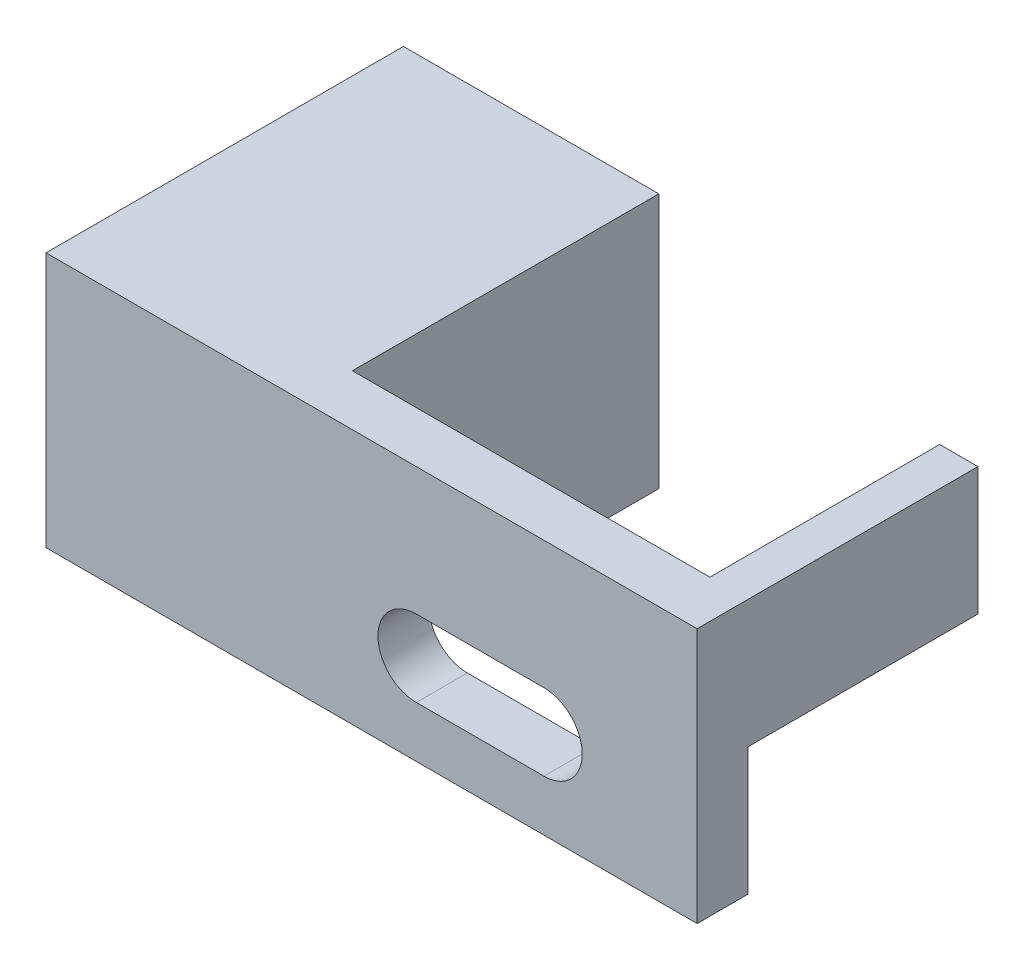
ISO-10303-21;
HEADER;
FILE_DESCRIPTION(('STEP AP214'),'2;1');
FILE_NAME('part.step','',(''),(''),'','','');
FILE_SCHEMA(('AUTOMOTIVE_DESIGN { 1 0 10303 214 1 1 1 1 }'));
ENDSEC;
DATA;
#1=APPLICATION_CONTEXT('core data for automotive mechanical design processes');
#2=APPLICATION_PROTOCOL_DEFINITION('international standard','automotive_design',2000,#1);
#3=PRODUCT_CONTEXT('',#1,'mechanical');
#4=PRODUCT('Part','Part','',(#3));
#5=PRODUCT_RELATED_PRODUCT_CATEGORY('part','',(#4));
#6=PRODUCT_DEFINITION_FORMATION('','',#4);
#7=PRODUCT_DEFINITION_CONTEXT('part definition',#1,'design');
#8=PRODUCT_DEFINITION('design','',#6,#7);
#9=PRODUCT_DEFINITION_SHAPE('','',#8);
#10=(LENGTH_UNIT() NAMED_UNIT(*) SI_UNIT(.MILLI.,.METRE.));
#11=(NAMED_UNIT(*) PLANE_ANGLE_UNIT() SI_UNIT($,.RADIAN.));
#12=(NAMED_UNIT(*) SI_UNIT($,.STERADIAN.) SOLID_ANGLE_UNIT());
#13=UNCERTAINTY_MEASURE_WITH_UNIT(LENGTH_MEASURE(1.E-05),#10,'distance_accuracy_value','');
#14=(GEOMETRIC_REPRESENTATION_CONTEXT(3) GLOBAL_UNCERTAINTY_ASSIGNED_CONTEXT((#13)) GLOBAL_UNIT_ASSIGNED_CONTEXT((#10,
#11,#12)) REPRESENTATION_CONTEXT('',''));
#15=CARTESIAN_POINT('',(0.,0.,0.));
#16=DIRECTION('',(0.,0.,1.));
#17=DIRECTION('',(1.,0.,0.));
#18=AXIS2_PLACEMENT_3D('',#15,#16,#17);
#19=CARTESIAN_POINT('',(0.,10.,-14.));
#20=DIRECTION('',(1.,0.,0.));
#21=DIRECTION('',(0.,0.,-1.));
#22=AXIS2_PLACEMENT_3D('',#19,#20,#21);
#23=PLANE('',#22);
#24=DIRECTION('',(0.,0.,1.));
#25=VECTOR('',#24,1.);
#26=CARTESIAN_POINT('',(0.,0.,-14.));
#27=LINE('',#26,#25);
#28=CARTESIAN_POINT('',(0.,0.,-14.));
#29=VERTEX_POINT('',#28);
#30=CARTESIAN_POINT('',(0.,0.,0.));
#31=VERTEX_POINT('',#30);
#32=EDGE_CURVE('E174',#29,#31,#27,.T.);
#33=ORIENTED_EDGE('',*,*,#32,.T.);
#34=DIRECTION('',(0.,-1.,0.));
#35=VECTOR('',#34,1.);
#36=CARTESIAN_POINT('',(0.,10.,0.));
#37=LINE('',#36,#35);
#38=CARTESIAN_POINT('',(0.,10.,0.));
#39=VERTEX_POINT('',#38);
#40=EDGE_CURVE('E11',#39,#31,#37,.T.);
#41=ORIENTED_EDGE('',*,*,#40,.F.);
#42=DIRECTION('',(0.,0.,1.));
#43=VECTOR('',#42,1.);
#44=CARTESIAN_POINT('',(0.,10.,-14.));
#45=LINE('',#44,#43);
#46=CARTESIAN_POINT('',(0.,10.,-14.));
#47=VERTEX_POINT('',#46);
#48=EDGE_CURVE('E176',#47,#39,#45,.T.);
#49=ORIENTED_EDGE('',*,*,#48,.F.);
#50=DIRECTION('',(0.,-1.,0.));
#51=VECTOR('',#50,1.);
#52=CARTESIAN_POINT('',(0.,10.,-14.));
#53=LINE('',#52,#51);
#54=EDGE_CURVE('E194',#47,#29,#53,.T.);
#55=ORIENTED_EDGE('',*,*,#54,.T.);
#56=EDGE_LOOP('',(#33,#41,#49,#55));
#57=FACE_BOUND('',#56,.T.);
#58=ADVANCED_FACE('F32',(#57),#23,.F.);
#59=CARTESIAN_POINT('',(0.,10.,0.));
#60=DIRECTION('',(0.,0.,-1.));
#61=DIRECTION('',(-1.,0.,0.));
#62=AXIS2_PLACEMENT_3D('',#59,#60,#61);
#63=PLANE('',#62);
#64=DIRECTION('',(-1.,0.,0.));
#65=VECTOR('',#64,1.);
#66=CARTESIAN_POINT('',(19.5,5.,0.));
#67=LINE('',#66,#65);
#68=CARTESIAN_POINT('',(19.5,5.,0.));
#69=VERTEX_POINT('',#68);
#70=CARTESIAN_POINT('',(14.5,5.,0.));
#71=VERTEX_POINT('',#70);
#72=EDGE_CURVE('E146',#69,#71,#67,.T.);
#73=ORIENTED_EDGE('',*,*,#72,.F.);
#74=CARTESIAN_POINT('',(19.5,3.5,0.));
#75=DIRECTION('',(0.,0.,-1.));
#76=DIRECTION('',(-1.,0.,0.));
#77=AXIS2_PLACEMENT_3D('',#74,#75,#76);
#78=CIRCLE('',#77,1.5);
#79=CARTESIAN_POINT('',(19.5,2.,0.));
#80=VERTEX_POINT('',#79);
#81=EDGE_CURVE('E128',#80,#69,#78,.F.);
#82=ORIENTED_EDGE('',*,*,#81,.F.);
#83=DIRECTION('',(1.,0.,0.));
#84=VECTOR('',#83,1.);
#85=CARTESIAN_POINT('',(19.5,2.,0.));
#86=LINE('',#85,#84);
#87=CARTESIAN_POINT('',(14.5,2.,0.));
#88=VERTEX_POINT('',#87);
#89=EDGE_CURVE('E137',#88,#80,#86,.T.);
#90=ORIENTED_EDGE('',*,*,#89,.F.);
#91=CARTESIAN_POINT('',(14.5,3.5,0.));
#92=DIRECTION('',(0.,0.,-1.));
#93=DIRECTION('',(-1.,0.,0.));
#94=AXIS2_PLACEMENT_3D('',#91,#92,#93);
#95=CIRCLE('',#94,1.5);
#96=EDGE_CURVE('E46',#71,#88,#95,.F.);
#97=ORIENTED_EDGE('',*,*,#96,.F.);
#98=EDGE_LOOP('',(#73,#82,#90,#97));
#99=FACE_BOUND('',#98,.T.);
#100=DIRECTION('',(1.,0.,0.));
#101=VECTOR('',#100,1.);
#102=CARTESIAN_POINT('',(0.,0.,0.));
#103=LINE('',#102,#101);
#104=CARTESIAN_POINT('',(25.5,0.,0.));
#105=VERTEX_POINT('',#104);
#106=EDGE_CURVE('E197',#31,#105,#103,.T.);
#107=ORIENTED_EDGE('',*,*,#106,.T.);
#108=DIRECTION('',(0.,-1.,0.));
#109=VECTOR('',#108,1.);
#110=CARTESIAN_POINT('',(25.5,10.,0.));
#111=LINE('',#110,#109);
#112=CARTESIAN_POINT('',(25.5,10.,0.));
#113=VERTEX_POINT('',#112);
#114=EDGE_CURVE('E39',#113,#105,#111,.T.);
#115=ORIENTED_EDGE('',*,*,#114,.F.);
#116=DIRECTION('',(1.,0.,0.));
#117=VECTOR('',#116,1.);
#118=CARTESIAN_POINT('',(0.,10.,0.));
#119=LINE('',#118,#117);
#120=EDGE_CURVE('E179',#39,#113,#119,.T.);
#121=ORIENTED_EDGE('',*,*,#120,.F.);
#122=ORIENTED_EDGE('',*,*,#40,.T.);
#123=EDGE_LOOP('',(#107,#115,#121,#122));
#124=FACE_BOUND('',#123,.T.);
#125=ADVANCED_FACE('F143',(#99,#124),#63,.F.);
#126=CARTESIAN_POINT('',(25.5,10.,0.));
#127=DIRECTION('',(-1.,0.,0.));
#128=DIRECTION('',(0.,0.,1.));
#129=AXIS2_PLACEMENT_3D('',#126,#127,#128);
#130=PLANE('',#129);
#131=DIRECTION('',(0.,-1.,0.));
#132=VECTOR('',#131,1.);
#133=CARTESIAN_POINT('',(25.5,5.,-2.));
#134=LINE('',#133,#132);
#135=CARTESIAN_POINT('',(25.5,5.,-2.));
#136=VERTEX_POINT('',#135);
#137=CARTESIAN_POINT('',(25.5,0.,-2.));
#138=VERTEX_POINT('',#137);
#139=EDGE_CURVE('E140',#136,#138,#134,.T.);
#140=ORIENTED_EDGE('',*,*,#139,.F.);
#141=DIRECTION('',(0.,0.,1.));
#142=VECTOR('',#141,1.);
#143=CARTESIAN_POINT('',(25.5,5.,-11.));
#144=LINE('',#143,#142);
#145=CARTESIAN_POINT('',(25.5,5.,-11.));
#146=VERTEX_POINT('',#145);
#147=EDGE_CURVE('E165',#146,#136,#144,.T.);
#148=ORIENTED_EDGE('',*,*,#147,.F.);
#149=DIRECTION('',(0.,-1.,0.));
#150=VECTOR('',#149,1.);
#151=CARTESIAN_POINT('',(25.5,10.,-11.));
#152=LINE('',#151,#150);
#153=CARTESIAN_POINT('',(25.5,10.,-11.));
#154=VERTEX_POINT('',#153);
#155=EDGE_CURVE('E221',#154,#146,#152,.T.);
#156=ORIENTED_EDGE('',*,*,#155,.F.);
#157=DIRECTION('',(0.,0.,-1.));
#158=VECTOR('',#157,1.);
#159=CARTESIAN_POINT('',(25.5,10.,0.));
#160=LINE('',#159,#158);
#161=EDGE_CURVE('E182',#113,#154,#160,.T.);
#162=ORIENTED_EDGE('',*,*,#161,.F.);
#163=ORIENTED_EDGE('',*,*,#114,.T.);
#164=DIRECTION('',(0.,0.,-1.));
#165=VECTOR('',#164,1.);
#166=CARTESIAN_POINT('',(25.5,0.,0.));
#167=LINE('',#166,#165);
#168=EDGE_CURVE('E199',#105,#138,#167,.T.);
#169=ORIENTED_EDGE('',*,*,#168,.T.);
#170=EDGE_LOOP('',(#140,#148,#156,#162,#163,#169));
#171=FACE_BOUND('',#170,.T.);
#172=ADVANCED_FACE('F229',(#171),#130,.F.);
#173=CARTESIAN_POINT('',(25.5,10.,-11.));
#174=DIRECTION('',(0.,0.,1.));
#175=DIRECTION('',(1.,0.,0.));
#176=AXIS2_PLACEMENT_3D('',#173,#174,#175);
#177=PLANE('',#176);
#178=ORIENTED_EDGE('',*,*,#155,.T.);
#179=DIRECTION('',(-1.,0.,0.));
#180=VECTOR('',#179,1.);
#181=CARTESIAN_POINT('',(25.501,5.,-11.));
#182=LINE('',#181,#180);
#183=CARTESIAN_POINT('',(24.,5.,-11.));
#184=VERTEX_POINT('',#183);
#185=EDGE_CURVE('E171',#146,#184,#182,.T.);
#186=ORIENTED_EDGE('',*,*,#185,.T.);
#187=DIRECTION('',(0.,-1.,0.));
#188=VECTOR('',#187,1.);
#189=CARTESIAN_POINT('',(24.,10.,-11.));
#190=LINE('',#189,#188);
#191=CARTESIAN_POINT('',(24.,10.,-11.));
#192=VERTEX_POINT('',#191);
#193=EDGE_CURVE('E218',#192,#184,#190,.T.);
#194=ORIENTED_EDGE('',*,*,#193,.F.);
#195=DIRECTION('',(-1.,0.,0.));
#196=VECTOR('',#195,1.);
#197=CARTESIAN_POINT('',(25.5,10.,-11.));
#198=LINE('',#197,#196);
#199=EDGE_CURVE('E184',#154,#192,#198,.T.);
#200=ORIENTED_EDGE('',*,*,#199,.F.);
#201=EDGE_LOOP('',(#178,#186,#194,#200));
#202=FACE_BOUND('',#201,.T.);
#203=ADVANCED_FACE('F243',(#202),#177,.F.);
#204=CARTESIAN_POINT('',(24.,10.,-11.));
#205=DIRECTION('',(1.,0.,0.));
#206=DIRECTION('',(0.,0.,-1.));
#207=AXIS2_PLACEMENT_3D('',#204,#205,#206);
#208=PLANE('',#207);
#209=ORIENTED_EDGE('',*,*,#193,.T.);
#210=DIRECTION('',(0.,0.,-1.));
#211=VECTOR('',#210,1.);
#212=CARTESIAN_POINT('',(24.,5.,-11.));
#213=LINE('',#212,#211);
#214=CARTESIAN_POINT('',(24.,5.,-2.));
#215=VERTEX_POINT('',#214);
#216=EDGE_CURVE('E168',#215,#184,#213,.T.);
#217=ORIENTED_EDGE('',*,*,#216,.F.);
#218=DIRECTION('',(0.,-1.,0.));
#219=VECTOR('',#218,1.);
#220=CARTESIAN_POINT('',(24.,10.,-2.));
#221=LINE('',#220,#219);
#222=CARTESIAN_POINT('',(24.,10.,-2.));
#223=VERTEX_POINT('',#222);
#224=EDGE_CURVE('E215',#223,#215,#221,.T.);
#225=ORIENTED_EDGE('',*,*,#224,.F.);
#226=DIRECTION('',(0.,0.,1.));
#227=VECTOR('',#226,1.);
#228=CARTESIAN_POINT('',(24.,10.,-11.));
#229=LINE('',#228,#227);
#230=EDGE_CURVE('E186',#192,#223,#229,.T.);
#231=ORIENTED_EDGE('',*,*,#230,.F.);
#232=EDGE_LOOP('',(#209,#217,#225,#231));
#233=FACE_BOUND('',#232,.T.);
#234=ADVANCED_FACE('F263',(#233),#208,.F.);
#235=CARTESIAN_POINT('',(24.,10.,-2.));
#236=DIRECTION('',(0.,0.,1.));
#237=DIRECTION('',(1.,0.,0.));
#238=AXIS2_PLACEMENT_3D('',#235,#236,#237);
#239=PLANE('',#238);
#240=DIRECTION('',(-1.,0.,0.));
#241=VECTOR('',#240,1.);
#242=CARTESIAN_POINT('',(19.5,2.,-2.));
#243=LINE('',#242,#241);
#244=CARTESIAN_POINT('',(19.5,2.,-2.));
#245=VERTEX_POINT('',#244);
#246=CARTESIAN_POINT('',(14.5,2.,-2.));
#247=VERTEX_POINT('',#246);
#248=EDGE_CURVE('E148',#245,#247,#243,.T.);
#249=ORIENTED_EDGE('',*,*,#248,.F.);
#250=CARTESIAN_POINT('',(19.5,3.5,-2.));
#251=DIRECTION('',(0.,0.,-1.));
#252=DIRECTION('',(-1.,0.,0.));
#253=AXIS2_PLACEMENT_3D('',#250,#251,#252);
#254=CIRCLE('',#253,1.5);
#255=CARTESIAN_POINT('',(19.5,5.,-2.));
#256=VERTEX_POINT('',#255);
#257=EDGE_CURVE('E54',#256,#245,#254,.T.);
#258=ORIENTED_EDGE('',*,*,#257,.F.);
#259=DIRECTION('',(1.,0.,0.));
#260=VECTOR('',#259,1.);
#261=CARTESIAN_POINT('',(19.5,5.,-2.));
#262=LINE('',#261,#260);
#263=CARTESIAN_POINT('',(14.5,5.,-2.));
#264=VERTEX_POINT('',#263);
#265=EDGE_CURVE('E134',#264,#256,#262,.T.);
#266=ORIENTED_EDGE('',*,*,#265,.F.);
#267=CARTESIAN_POINT('',(14.5,3.5,-2.));
#268=DIRECTION('',(0.,0.,-1.));
#269=DIRECTION('',(-1.,0.,0.));
#270=AXIS2_PLACEMENT_3D('',#267,#268,#269);
#271=CIRCLE('',#270,1.5);
#272=EDGE_CURVE('E154',#247,#264,#271,.T.);
#273=ORIENTED_EDGE('',*,*,#272,.F.);
#274=EDGE_LOOP('',(#249,#258,#266,#273));
#275=FACE_BOUND('',#274,.T.);
#276=DIRECTION('',(-1.,0.,0.));
#277=VECTOR('',#276,1.);
#278=CARTESIAN_POINT('',(24.,0.,-2.));
#279=LINE('',#278,#277);
#280=CARTESIAN_POINT('',(10.,0.,-2.));
#281=VERTEX_POINT('',#280);
#282=EDGE_CURVE('E202',#138,#281,#279,.T.);
#283=ORIENTED_EDGE('',*,*,#282,.T.);
#284=DIRECTION('',(0.,-1.,0.));
#285=VECTOR('',#284,1.);
#286=CARTESIAN_POINT('',(10.,10.,-2.));
#287=LINE('',#286,#285);
#288=CARTESIAN_POINT('',(10.,10.,-2.));
#289=VERTEX_POINT('',#288);
#290=EDGE_CURVE('E212',#289,#281,#287,.T.);
#291=ORIENTED_EDGE('',*,*,#290,.F.);
#292=DIRECTION('',(-1.,0.,0.));
#293=VECTOR('',#292,1.);
#294=CARTESIAN_POINT('',(24.,10.,-2.));
#295=LINE('',#294,#293);
#296=EDGE_CURVE('E188',#223,#289,#295,.T.);
#297=ORIENTED_EDGE('',*,*,#296,.F.);
#298=ORIENTED_EDGE('',*,*,#224,.T.);
#299=DIRECTION('',(-1.,0.,0.));
#300=VECTOR('',#299,1.);
#301=CARTESIAN_POINT('',(25.501,5.,-2.));
#302=LINE('',#301,#300);
#303=EDGE_CURVE('E170',#136,#215,#302,.T.);
#304=ORIENTED_EDGE('',*,*,#303,.F.);
#305=ORIENTED_EDGE('',*,*,#139,.T.);
#306=EDGE_LOOP('',(#283,#291,#297,#298,#304,#305));
#307=FACE_BOUND('',#306,.T.);
#308=ADVANCED_FACE('F238',(#275,#307),#239,.F.);
#309=CARTESIAN_POINT('',(10.,10.,-2.));
#310=DIRECTION('',(-1.,0.,0.));
#311=DIRECTION('',(0.,0.,1.));
#312=AXIS2_PLACEMENT_3D('',#309,#310,#311);
#313=PLANE('',#312);
#314=DIRECTION('',(0.,0.,-1.));
#315=VECTOR('',#314,1.);
#316=CARTESIAN_POINT('',(10.,0.,-2.));
#317=LINE('',#316,#315);
#318=CARTESIAN_POINT('',(10.,0.,-14.));
#319=VERTEX_POINT('',#318);
#320=EDGE_CURVE('E204',#281,#319,#317,.T.);
#321=ORIENTED_EDGE('',*,*,#320,.T.);
#322=DIRECTION('',(0.,-1.,0.));
#323=VECTOR('',#322,1.);
#324=CARTESIAN_POINT('',(10.,10.,-14.));
#325=LINE('',#324,#323);
#326=CARTESIAN_POINT('',(10.,10.,-14.));
#327=VERTEX_POINT('',#326);
#328=EDGE_CURVE('E209',#327,#319,#325,.T.);
#329=ORIENTED_EDGE('',*,*,#328,.F.);
#330=DIRECTION('',(0.,0.,-1.));
#331=VECTOR('',#330,1.);
#332=CARTESIAN_POINT('',(10.,10.,-2.));
#333=LINE('',#332,#331);
#334=EDGE_CURVE('E190',#289,#327,#333,.T.);
#335=ORIENTED_EDGE('',*,*,#334,.F.);
#336=ORIENTED_EDGE('',*,*,#290,.T.);
#337=EDGE_LOOP('',(#321,#329,#335,#336));
#338=FACE_BOUND('',#337,.T.);
#339=ADVANCED_FACE('F259',(#338),#313,.F.);
#340=CARTESIAN_POINT('',(10.,10.,-14.));
#341=DIRECTION('',(0.,0.,1.));
#342=DIRECTION('',(1.,0.,0.));
#343=AXIS2_PLACEMENT_3D('',#340,#341,#342);
#344=PLANE('',#343);
#345=DIRECTION('',(-1.,0.,0.));
#346=VECTOR('',#345,1.);
#347=CARTESIAN_POINT('',(10.,0.,-14.));
#348=LINE('',#347,#346);
#349=EDGE_CURVE('E180',#319,#29,#348,.T.);
#350=ORIENTED_EDGE('',*,*,#349,.T.);
#351=ORIENTED_EDGE('',*,*,#54,.F.);
#352=DIRECTION('',(-1.,0.,0.));
#353=VECTOR('',#352,1.);
#354=CARTESIAN_POINT('',(10.,10.,-14.));
#355=LINE('',#354,#353);
#356=EDGE_CURVE('E192',#327,#47,#355,.T.);
#357=ORIENTED_EDGE('',*,*,#356,.F.);
#358=ORIENTED_EDGE('',*,*,#328,.T.);
#359=EDGE_LOOP('',(#350,#351,#357,#358));
#360=FACE_BOUND('',#359,.T.);
#361=ADVANCED_FACE('F254',(#360),#344,.F.);
#362=CARTESIAN_POINT('',(0.,10.,0.));
#363=DIRECTION('',(0.,1.,0.));
#364=DIRECTION('',(0.,0.,1.));
#365=AXIS2_PLACEMENT_3D('',#362,#363,#364);
#366=PLANE('',#365);
#367=ORIENTED_EDGE('',*,*,#48,.T.);
#368=ORIENTED_EDGE('',*,*,#120,.T.);
#369=ORIENTED_EDGE('',*,*,#161,.T.);
#370=ORIENTED_EDGE('',*,*,#199,.T.);
#371=ORIENTED_EDGE('',*,*,#230,.T.);
#372=ORIENTED_EDGE('',*,*,#296,.T.);
#373=ORIENTED_EDGE('',*,*,#334,.T.);
#374=ORIENTED_EDGE('',*,*,#356,.T.);
#375=EDGE_LOOP('',(#367,#368,#369,#370,#371,#372,#373,#374));
#376=FACE_BOUND('',#375,.T.);
#377=ADVANCED_FACE('F247',(#376),#366,.T.);
#378=CARTESIAN_POINT('',(0.,0.,0.));
#379=DIRECTION('',(0.,1.,0.));
#380=DIRECTION('',(0.,0.,1.));
#381=AXIS2_PLACEMENT_3D('',#378,#379,#380);
#382=PLANE('',#381);
#383=ORIENTED_EDGE('',*,*,#282,.F.);
#384=ORIENTED_EDGE('',*,*,#168,.F.);
#385=ORIENTED_EDGE('',*,*,#106,.F.);
#386=ORIENTED_EDGE('',*,*,#32,.F.);
#387=ORIENTED_EDGE('',*,*,#349,.F.);
#388=ORIENTED_EDGE('',*,*,#320,.F.);
#389=EDGE_LOOP('',(#383,#384,#385,#386,#387,#388));
#390=FACE_BOUND('',#389,.T.);
#391=ADVANCED_FACE('F232',(#390),#382,.F.);
#392=CARTESIAN_POINT('',(25.501,5.,-11.));
#393=DIRECTION('',(0.,1.,0.));
#394=DIRECTION('',(0.,0.,1.));
#395=AXIS2_PLACEMENT_3D('',#392,#393,#394);
#396=PLANE('',#395);
#397=ORIENTED_EDGE('',*,*,#147,.T.);
#398=ORIENTED_EDGE('',*,*,#303,.T.);
#399=ORIENTED_EDGE('',*,*,#216,.T.);
#400=ORIENTED_EDGE('',*,*,#185,.F.);
#401=EDGE_LOOP('',(#397,#398,#399,#400));
#402=FACE_BOUND('',#401,.T.);
#403=ADVANCED_FACE('F264',(#402),#396,.F.);
#404=CARTESIAN_POINT('',(19.5,3.5,0.001000000000001));
#405=DIRECTION('',(0.,0.,-1.));
#406=DIRECTION('',(-1.,0.,0.));
#407=AXIS2_PLACEMENT_3D('',#404,#405,#406);
#408=CYLINDRICAL_SURFACE('',#407,1.5);
#409=ORIENTED_EDGE('',*,*,#81,.T.);
#410=DIRECTION('',(0.,0.,-1.));
#411=VECTOR('',#410,1.);
#412=CARTESIAN_POINT('',(19.5,5.,0.001000000000001));
#413=LINE('',#412,#411);
#414=EDGE_CURVE('E141',#69,#256,#413,.T.);
#415=ORIENTED_EDGE('',*,*,#414,.T.);
#416=ORIENTED_EDGE('',*,*,#257,.T.);
#417=DIRECTION('',(0.,0.,-1.));
#418=VECTOR('',#417,1.);
#419=CARTESIAN_POINT('',(19.5,2.,0.001000000000001));
#420=LINE('',#419,#418);
#421=EDGE_CURVE('E124',#80,#245,#420,.T.);
#422=ORIENTED_EDGE('',*,*,#421,.F.);
#423=EDGE_LOOP('',(#409,#415,#416,#422));
#424=FACE_BOUND('',#423,.T.);
#425=ADVANCED_FACE('F126',(#424),#408,.F.);
#426=CARTESIAN_POINT('',(19.5,5.,0.001000000000001));
#427=DIRECTION('',(0.,1.,0.));
#428=DIRECTION('',(0.,0.,1.));
#429=AXIS2_PLACEMENT_3D('',#426,#427,#428);
#430=PLANE('',#429);
#431=ORIENTED_EDGE('',*,*,#72,.T.);
#432=DIRECTION('',(0.,0.,-1.));
#433=VECTOR('',#432,1.);
#434=CARTESIAN_POINT('',(14.5,5.,0.00100000000000187));
#435=LINE('',#434,#433);
#436=EDGE_CURVE('E160',#71,#264,#435,.T.);
#437=ORIENTED_EDGE('',*,*,#436,.T.);
#438=ORIENTED_EDGE('',*,*,#265,.T.);
#439=ORIENTED_EDGE('',*,*,#414,.F.);
#440=EDGE_LOOP('',(#431,#437,#438,#439));
#441=FACE_BOUND('',#440,.T.);
#442=ADVANCED_FACE('F271',(#441),#430,.F.);
#443=CARTESIAN_POINT('',(14.5,3.5,0.00100000000000187));
#444=DIRECTION('',(0.,0.,-1.));
#445=DIRECTION('',(-1.,0.,0.));
#446=AXIS2_PLACEMENT_3D('',#443,#444,#445);
#447=CYLINDRICAL_SURFACE('',#446,1.5);
#448=ORIENTED_EDGE('',*,*,#96,.T.);
#449=DIRECTION('',(0.,0.,-1.));
#450=VECTOR('',#449,1.);
#451=CARTESIAN_POINT('',(14.5,2.,0.00100000000000187));
#452=LINE('',#451,#450);
#453=EDGE_CURVE('E133',#88,#247,#452,.T.);
#454=ORIENTED_EDGE('',*,*,#453,.T.);
#455=ORIENTED_EDGE('',*,*,#272,.T.);
#456=ORIENTED_EDGE('',*,*,#436,.F.);
#457=EDGE_LOOP('',(#448,#454,#455,#456));
#458=FACE_BOUND('',#457,.T.);
#459=ADVANCED_FACE('F340',(#458),#447,.F.);
#460=CARTESIAN_POINT('',(19.5,2.,0.001000000000001));
#461=DIRECTION('',(0.,-1.,0.));
#462=DIRECTION('',(0.,0.,-1.));
#463=AXIS2_PLACEMENT_3D('',#460,#461,#462);
#464=PLANE('',#463);
#465=ORIENTED_EDGE('',*,*,#89,.T.);
#466=ORIENTED_EDGE('',*,*,#421,.T.);
#467=ORIENTED_EDGE('',*,*,#248,.T.);
#468=ORIENTED_EDGE('',*,*,#453,.F.);
#469=EDGE_LOOP('',(#465,#466,#467,#468));
#470=FACE_BOUND('',#469,.T.);
#471=ADVANCED_FACE('F138',(#470),#464,.F.);
#472=CLOSED_SHELL('',(#58,#125,#172,#203,#234,#308,#339,#361,#377,#391,#403,#425,#442,#459,#471));
#473=MANIFOLD_SOLID_BREP('B2',#472);
#474=ADVANCED_BREP_SHAPE_REPRESENTATION('',(#18,#473),#14);
#475=SHAPE_DEFINITION_REPRESENTATION(#9,#474);
ENDSEC;
END-ISO-10303-21;
